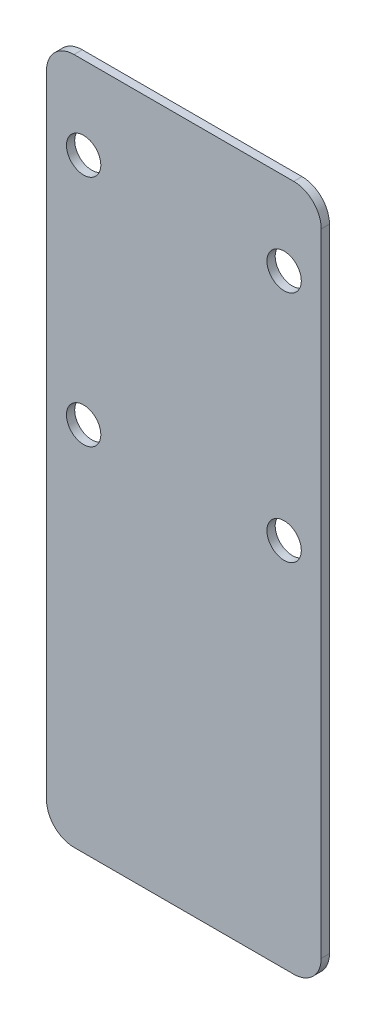
ISO-10303-21;
HEADER;
FILE_DESCRIPTION(('STEP AP214'),'2;1');
FILE_NAME('part.step','',(''),(''),'','','');
FILE_SCHEMA(('AUTOMOTIVE_DESIGN { 1 0 10303 214 1 1 1 1 }'));
ENDSEC;
DATA;
#1=APPLICATION_CONTEXT('core data for automotive mechanical design processes');
#2=APPLICATION_PROTOCOL_DEFINITION('international standard','automotive_design',2000,#1);
#3=PRODUCT_CONTEXT('',#1,'mechanical');
#4=PRODUCT('Part','Part','',(#3));
#5=PRODUCT_RELATED_PRODUCT_CATEGORY('part','',(#4));
#6=PRODUCT_DEFINITION_FORMATION('','',#4);
#7=PRODUCT_DEFINITION_CONTEXT('part definition',#1,'design');
#8=PRODUCT_DEFINITION('design','',#6,#7);
#9=PRODUCT_DEFINITION_SHAPE('','',#8);
#10=(LENGTH_UNIT() NAMED_UNIT(*) SI_UNIT(.MILLI.,.METRE.));
#11=(NAMED_UNIT(*) PLANE_ANGLE_UNIT() SI_UNIT($,.RADIAN.));
#12=(NAMED_UNIT(*) SI_UNIT($,.STERADIAN.) SOLID_ANGLE_UNIT());
#13=UNCERTAINTY_MEASURE_WITH_UNIT(LENGTH_MEASURE(1.E-05),#10,'distance_accuracy_value','');
#14=(GEOMETRIC_REPRESENTATION_CONTEXT(3) GLOBAL_UNCERTAINTY_ASSIGNED_CONTEXT((#13)) GLOBAL_UNIT_ASSIGNED_CONTEXT((#10,
#11,#12)) REPRESENTATION_CONTEXT('',''));
#15=CARTESIAN_POINT('',(0.,0.,0.));
#16=DIRECTION('',(0.,0.,1.));
#17=DIRECTION('',(1.,0.,0.));
#18=AXIS2_PLACEMENT_3D('',#15,#16,#17);
#19=CARTESIAN_POINT('',(1.16573417585641E-12,-7.7715611723761E-13,-222.));
#20=DIRECTION('',(0.,0.,-1.));
#21=DIRECTION('',(-1.,0.,0.));
#22=AXIS2_PLACEMENT_3D('',#19,#20,#21);
#23=PLANE('',#22);
#24=DIRECTION('',(-1.,0.,0.));
#25=VECTOR('',#24,1.);
#26=CARTESIAN_POINT('',(50.0000000000002,806.107463703936,-222.));
#27=LINE('',#26,#25);
#28=CARTESIAN_POINT('',(40.0000000000002,806.107463703936,-222.));
#29=VERTEX_POINT('',#28);
#30=CARTESIAN_POINT('',(-39.9999999999998,806.107463703936,-222.));
#31=VERTEX_POINT('',#30);
#32=EDGE_CURVE('E144',#29,#31,#27,.T.);
#33=ORIENTED_EDGE('',*,*,#32,.T.);
#34=CARTESIAN_POINT('',(-39.9999999999998,796.107463703936,-222.));
#35=DIRECTION('',(0.,0.,-1.));
#36=DIRECTION('',(-1.,0.,0.));
#37=AXIS2_PLACEMENT_3D('',#34,#35,#36);
#38=CIRCLE('',#37,10.);
#39=CARTESIAN_POINT('',(-49.9999999999998,796.107463703936,-222.));
#40=VERTEX_POINT('',#39);
#41=EDGE_CURVE('E162',#31,#40,#38,.F.);
#42=ORIENTED_EDGE('',*,*,#41,.T.);
#43=DIRECTION('',(0.,-1.,0.));
#44=VECTOR('',#43,1.);
#45=CARTESIAN_POINT('',(-49.9999999999998,806.107463703936,-222.));
#46=LINE('',#45,#44);
#47=CARTESIAN_POINT('',(-49.9999999999998,566.107463703936,-222.));
#48=VERTEX_POINT('',#47);
#49=EDGE_CURVE('E126',#40,#48,#46,.T.);
#50=ORIENTED_EDGE('',*,*,#49,.T.);
#51=CARTESIAN_POINT('',(-39.9999999999998,566.107463703936,-222.));
#52=DIRECTION('',(0.,0.,-1.));
#53=DIRECTION('',(-1.,0.,0.));
#54=AXIS2_PLACEMENT_3D('',#51,#52,#53);
#55=CIRCLE('',#54,10.);
#56=CARTESIAN_POINT('',(-39.9999999999998,556.107463703936,-222.));
#57=VERTEX_POINT('',#56);
#58=EDGE_CURVE('E159',#48,#57,#55,.F.);
#59=ORIENTED_EDGE('',*,*,#58,.T.);
#60=DIRECTION('',(1.,0.,0.));
#61=VECTOR('',#60,1.);
#62=CARTESIAN_POINT('',(50.0000000000002,556.107463703936,-222.));
#63=LINE('',#62,#61);
#64=CARTESIAN_POINT('',(40.0000000000002,556.107463703936,-222.));
#65=VERTEX_POINT('',#64);
#66=EDGE_CURVE('E173',#57,#65,#63,.T.);
#67=ORIENTED_EDGE('',*,*,#66,.T.);
#68=CARTESIAN_POINT('',(40.0000000000002,566.107463703936,-222.));
#69=DIRECTION('',(0.,0.,-1.));
#70=DIRECTION('',(-1.,0.,0.));
#71=AXIS2_PLACEMENT_3D('',#68,#69,#70);
#72=CIRCLE('',#71,10.);
#73=CARTESIAN_POINT('',(50.0000000000002,566.107463703936,-222.));
#74=VERTEX_POINT('',#73);
#75=EDGE_CURVE('E62',#65,#74,#72,.F.);
#76=ORIENTED_EDGE('',*,*,#75,.T.);
#77=DIRECTION('',(0.,1.,0.));
#78=VECTOR('',#77,1.);
#79=CARTESIAN_POINT('',(50.0000000000002,806.107463703936,-222.));
#80=LINE('',#79,#78);
#81=CARTESIAN_POINT('',(50.0000000000002,796.107463703936,-222.));
#82=VERTEX_POINT('',#81);
#83=EDGE_CURVE('E181',#74,#82,#80,.T.);
#84=ORIENTED_EDGE('',*,*,#83,.T.);
#85=CARTESIAN_POINT('',(40.0000000000002,796.107463703936,-222.));
#86=DIRECTION('',(0.,0.,-1.));
#87=DIRECTION('',(-1.,0.,0.));
#88=AXIS2_PLACEMENT_3D('',#85,#86,#87);
#89=CIRCLE('',#88,10.);
#90=EDGE_CURVE('E157',#82,#29,#89,.F.);
#91=ORIENTED_EDGE('',*,*,#90,.T.);
#92=EDGE_LOOP('',(#33,#42,#50,#59,#67,#76,#84,#91));
#93=FACE_BOUND('',#92,.T.);
#94=CARTESIAN_POINT('',(36.5000000000002,776.107463703936,-222.));
#95=DIRECTION('',(0.,0.,1.));
#96=DIRECTION('',(1.,0.,0.));
#97=AXIS2_PLACEMENT_3D('',#94,#95,#96);
#98=CIRCLE('',#97,6.24999999999994);
#99=CARTESIAN_POINT('',(42.7500000000001,776.107463703936,-222.));
#100=VERTEX_POINT('',#99);
#101=EDGE_CURVE('E135',#100,#100,#98,.T.);
#102=ORIENTED_EDGE('',*,*,#101,.F.);
#103=EDGE_LOOP('',(#102));
#104=FACE_BOUND('',#103,.T.);
#105=CARTESIAN_POINT('',(-36.4999999999998,776.107463703936,-222.));
#106=DIRECTION('',(0.,0.,1.));
#107=DIRECTION('',(-1.,0.,0.));
#108=AXIS2_PLACEMENT_3D('',#105,#106,#107);
#109=CIRCLE('',#108,6.24999999999994);
#110=CARTESIAN_POINT('',(-42.7499999999998,776.107463703936,-222.));
#111=VERTEX_POINT('',#110);
#112=EDGE_CURVE('E188',#111,#111,#109,.T.);
#113=ORIENTED_EDGE('',*,*,#112,.F.);
#114=EDGE_LOOP('',(#113));
#115=FACE_BOUND('',#114,.T.);
#116=CARTESIAN_POINT('',(36.5000000000002,691.107463703936,-222.));
#117=DIRECTION('',(0.,0.,1.));
#118=DIRECTION('',(1.,0.,0.));
#119=AXIS2_PLACEMENT_3D('',#116,#117,#118);
#120=CIRCLE('',#119,6.24999999999993);
#121=CARTESIAN_POINT('',(42.7500000000001,691.107463703936,-222.));
#122=VERTEX_POINT('',#121);
#123=EDGE_CURVE('E193',#122,#122,#120,.T.);
#124=ORIENTED_EDGE('',*,*,#123,.F.);
#125=EDGE_LOOP('',(#124));
#126=FACE_BOUND('',#125,.T.);
#127=CARTESIAN_POINT('',(-36.4999999999998,691.107463703936,-222.));
#128=DIRECTION('',(0.,0.,1.));
#129=DIRECTION('',(-1.,0.,0.));
#130=AXIS2_PLACEMENT_3D('',#127,#128,#129);
#131=CIRCLE('',#130,6.24999999999993);
#132=CARTESIAN_POINT('',(-42.7499999999998,691.107463703936,-222.));
#133=VERTEX_POINT('',#132);
#134=EDGE_CURVE('E199',#133,#133,#131,.T.);
#135=ORIENTED_EDGE('',*,*,#134,.F.);
#136=EDGE_LOOP('',(#135));
#137=FACE_BOUND('',#136,.T.);
#138=ADVANCED_FACE('F40',(#93,#104,#115,#126,#137),#23,.F.);
#139=CARTESIAN_POINT('',(1.16573417585641E-12,-7.7715611723761E-13,-225.));
#140=DIRECTION('',(0.,0.,-1.));
#141=DIRECTION('',(-1.,0.,0.));
#142=AXIS2_PLACEMENT_3D('',#139,#140,#141);
#143=PLANE('',#142);
#144=CARTESIAN_POINT('',(36.5000000000002,691.107463703936,-225.));
#145=DIRECTION('',(0.,0.,1.));
#146=DIRECTION('',(1.,0.,0.));
#147=AXIS2_PLACEMENT_3D('',#144,#145,#146);
#148=CIRCLE('',#147,6.24999999999993);
#149=CARTESIAN_POINT('',(42.7500000000001,691.107463703936,-225.));
#150=VERTEX_POINT('',#149);
#151=EDGE_CURVE('E196',#150,#150,#148,.T.);
#152=ORIENTED_EDGE('',*,*,#151,.T.);
#153=EDGE_LOOP('',(#152));
#154=FACE_BOUND('',#153,.T.);
#155=CARTESIAN_POINT('',(36.5000000000002,776.107463703936,-225.));
#156=DIRECTION('',(0.,0.,1.));
#157=DIRECTION('',(1.,0.,0.));
#158=AXIS2_PLACEMENT_3D('',#155,#156,#157);
#159=CIRCLE('',#158,6.24999999999994);
#160=CARTESIAN_POINT('',(42.7500000000001,776.107463703936,-225.));
#161=VERTEX_POINT('',#160);
#162=EDGE_CURVE('E141',#161,#161,#159,.T.);
#163=ORIENTED_EDGE('',*,*,#162,.T.);
#164=EDGE_LOOP('',(#163));
#165=FACE_BOUND('',#164,.T.);
#166=DIRECTION('',(0.,-1.,0.));
#167=VECTOR('',#166,1.);
#168=CARTESIAN_POINT('',(-49.9999999999998,806.107463703936,-225.));
#169=LINE('',#168,#167);
#170=CARTESIAN_POINT('',(-49.9999999999998,796.107463703936,-225.));
#171=VERTEX_POINT('',#170);
#172=CARTESIAN_POINT('',(-49.9999999999998,566.107463703936,-225.));
#173=VERTEX_POINT('',#172);
#174=EDGE_CURVE('E123',#171,#173,#169,.T.);
#175=ORIENTED_EDGE('',*,*,#174,.F.);
#176=CARTESIAN_POINT('',(-39.9999999999998,796.107463703936,-225.));
#177=DIRECTION('',(0.,0.,-1.));
#178=DIRECTION('',(-1.,0.,0.));
#179=AXIS2_PLACEMENT_3D('',#176,#177,#178);
#180=CIRCLE('',#179,10.);
#181=CARTESIAN_POINT('',(-39.9999999999998,806.107463703936,-225.));
#182=VERTEX_POINT('',#181);
#183=EDGE_CURVE('E106',#171,#182,#180,.T.);
#184=ORIENTED_EDGE('',*,*,#183,.T.);
#185=DIRECTION('',(-1.,0.,0.));
#186=VECTOR('',#185,1.);
#187=CARTESIAN_POINT('',(50.0000000000002,806.107463703936,-225.));
#188=LINE('',#187,#186);
#189=CARTESIAN_POINT('',(40.0000000000002,806.107463703936,-225.));
#190=VERTEX_POINT('',#189);
#191=EDGE_CURVE('E148',#190,#182,#188,.T.);
#192=ORIENTED_EDGE('',*,*,#191,.F.);
#193=CARTESIAN_POINT('',(40.0000000000002,796.107463703936,-225.));
#194=DIRECTION('',(0.,0.,-1.));
#195=DIRECTION('',(-1.,0.,0.));
#196=AXIS2_PLACEMENT_3D('',#193,#194,#195);
#197=CIRCLE('',#196,10.);
#198=CARTESIAN_POINT('',(50.0000000000002,796.107463703936,-225.));
#199=VERTEX_POINT('',#198);
#200=EDGE_CURVE('E127',#190,#199,#197,.T.);
#201=ORIENTED_EDGE('',*,*,#200,.T.);
#202=DIRECTION('',(0.,1.,0.));
#203=VECTOR('',#202,1.);
#204=CARTESIAN_POINT('',(50.0000000000002,806.107463703936,-225.));
#205=LINE('',#204,#203);
#206=CARTESIAN_POINT('',(50.0000000000002,566.107463703936,-225.));
#207=VERTEX_POINT('',#206);
#208=EDGE_CURVE('E138',#207,#199,#205,.T.);
#209=ORIENTED_EDGE('',*,*,#208,.F.);
#210=CARTESIAN_POINT('',(40.0000000000002,566.107463703936,-225.));
#211=DIRECTION('',(0.,0.,-1.));
#212=DIRECTION('',(-1.,0.,0.));
#213=AXIS2_PLACEMENT_3D('',#210,#211,#212);
#214=CIRCLE('',#213,10.);
#215=CARTESIAN_POINT('',(40.0000000000002,556.107463703936,-225.));
#216=VERTEX_POINT('',#215);
#217=EDGE_CURVE('E117',#207,#216,#214,.T.);
#218=ORIENTED_EDGE('',*,*,#217,.T.);
#219=DIRECTION('',(1.,0.,0.));
#220=VECTOR('',#219,1.);
#221=CARTESIAN_POINT('',(50.0000000000002,556.107463703936,-225.));
#222=LINE('',#221,#220);
#223=CARTESIAN_POINT('',(-39.9999999999998,556.107463703936,-225.));
#224=VERTEX_POINT('',#223);
#225=EDGE_CURVE('E134',#224,#216,#222,.T.);
#226=ORIENTED_EDGE('',*,*,#225,.F.);
#227=CARTESIAN_POINT('',(-39.9999999999998,566.107463703936,-225.));
#228=DIRECTION('',(0.,0.,-1.));
#229=DIRECTION('',(-1.,0.,0.));
#230=AXIS2_PLACEMENT_3D('',#227,#228,#229);
#231=CIRCLE('',#230,10.);
#232=EDGE_CURVE('E133',#224,#173,#231,.T.);
#233=ORIENTED_EDGE('',*,*,#232,.T.);
#234=EDGE_LOOP('',(#175,#184,#192,#201,#209,#218,#226,#233));
#235=FACE_BOUND('',#234,.T.);
#236=CARTESIAN_POINT('',(-36.4999999999998,776.107463703936,-225.));
#237=DIRECTION('',(0.,0.,1.));
#238=DIRECTION('',(-1.,0.,0.));
#239=AXIS2_PLACEMENT_3D('',#236,#237,#238);
#240=CIRCLE('',#239,6.24999999999994);
#241=CARTESIAN_POINT('',(-42.7499999999998,776.107463703936,-225.));
#242=VERTEX_POINT('',#241);
#243=EDGE_CURVE('E190',#242,#242,#240,.T.);
#244=ORIENTED_EDGE('',*,*,#243,.T.);
#245=EDGE_LOOP('',(#244));
#246=FACE_BOUND('',#245,.T.);
#247=CARTESIAN_POINT('',(-36.4999999999998,691.107463703936,-225.));
#248=DIRECTION('',(0.,0.,1.));
#249=DIRECTION('',(-1.,0.,0.));
#250=AXIS2_PLACEMENT_3D('',#247,#248,#249);
#251=CIRCLE('',#250,6.24999999999993);
#252=CARTESIAN_POINT('',(-42.7499999999998,691.107463703936,-225.));
#253=VERTEX_POINT('',#252);
#254=EDGE_CURVE('E202',#253,#253,#251,.T.);
#255=ORIENTED_EDGE('',*,*,#254,.T.);
#256=EDGE_LOOP('',(#255));
#257=FACE_BOUND('',#256,.T.);
#258=ADVANCED_FACE('F130',(#154,#165,#235,#246,#257),#143,.T.);
#259=CARTESIAN_POINT('',(-49.9999999999998,806.107463703936,-222.));
#260=DIRECTION('',(1.,0.,0.));
#261=DIRECTION('',(0.,1.,0.));
#262=AXIS2_PLACEMENT_3D('',#259,#260,#261);
#263=PLANE('',#262);
#264=ORIENTED_EDGE('',*,*,#49,.F.);
#265=DIRECTION('',(0.,0.,-1.));
#266=VECTOR('',#265,1.);
#267=CARTESIAN_POINT('',(-49.9999999999998,796.107463703936,-222.));
#268=LINE('',#267,#266);
#269=EDGE_CURVE('E110',#40,#171,#268,.T.);
#270=ORIENTED_EDGE('',*,*,#269,.T.);
#271=ORIENTED_EDGE('',*,*,#174,.T.);
#272=DIRECTION('',(0.,0.,-1.));
#273=VECTOR('',#272,1.);
#274=CARTESIAN_POINT('',(-49.9999999999998,566.107463703936,-222.));
#275=LINE('',#274,#273);
#276=EDGE_CURVE('E128',#173,#48,#275,.F.);
#277=ORIENTED_EDGE('',*,*,#276,.T.);
#278=EDGE_LOOP('',(#264,#270,#271,#277));
#279=FACE_BOUND('',#278,.T.);
#280=ADVANCED_FACE('F122',(#279),#263,.F.);
#281=CARTESIAN_POINT('',(50.0000000000002,556.107463703936,-222.));
#282=DIRECTION('',(0.,1.,0.));
#283=DIRECTION('',(0.,0.,1.));
#284=AXIS2_PLACEMENT_3D('',#281,#282,#283);
#285=PLANE('',#284);
#286=ORIENTED_EDGE('',*,*,#225,.T.);
#287=DIRECTION('',(0.,0.,-1.));
#288=VECTOR('',#287,1.);
#289=CARTESIAN_POINT('',(40.0000000000002,556.107463703936,-222.));
#290=LINE('',#289,#288);
#291=EDGE_CURVE('E11',#216,#65,#290,.F.);
#292=ORIENTED_EDGE('',*,*,#291,.T.);
#293=ORIENTED_EDGE('',*,*,#66,.F.);
#294=DIRECTION('',(0.,0.,-1.));
#295=VECTOR('',#294,1.);
#296=CARTESIAN_POINT('',(-39.9999999999998,556.107463703936,-222.));
#297=LINE('',#296,#295);
#298=EDGE_CURVE('E48',#57,#224,#297,.T.);
#299=ORIENTED_EDGE('',*,*,#298,.T.);
#300=EDGE_LOOP('',(#286,#292,#293,#299));
#301=FACE_BOUND('',#300,.T.);
#302=ADVANCED_FACE('F171',(#301),#285,.F.);
#303=CARTESIAN_POINT('',(50.0000000000002,806.107463703936,-222.));
#304=DIRECTION('',(-1.,0.,0.));
#305=DIRECTION('',(0.,-1.,0.));
#306=AXIS2_PLACEMENT_3D('',#303,#304,#305);
#307=PLANE('',#306);
#308=ORIENTED_EDGE('',*,*,#83,.F.);
#309=DIRECTION('',(0.,0.,-1.));
#310=VECTOR('',#309,1.);
#311=CARTESIAN_POINT('',(50.0000000000002,566.107463703936,-222.));
#312=LINE('',#311,#310);
#313=EDGE_CURVE('E165',#74,#207,#312,.T.);
#314=ORIENTED_EDGE('',*,*,#313,.T.);
#315=ORIENTED_EDGE('',*,*,#208,.T.);
#316=DIRECTION('',(0.,0.,-1.));
#317=VECTOR('',#316,1.);
#318=CARTESIAN_POINT('',(50.0000000000002,796.107463703936,-222.));
#319=LINE('',#318,#317);
#320=EDGE_CURVE('E55',#199,#82,#319,.F.);
#321=ORIENTED_EDGE('',*,*,#320,.T.);
#322=EDGE_LOOP('',(#308,#314,#315,#321));
#323=FACE_BOUND('',#322,.T.);
#324=ADVANCED_FACE('F180',(#323),#307,.F.);
#325=CARTESIAN_POINT('',(50.0000000000002,806.107463703936,-222.));
#326=DIRECTION('',(0.,-1.,0.));
#327=DIRECTION('',(0.,0.,-1.));
#328=AXIS2_PLACEMENT_3D('',#325,#326,#327);
#329=PLANE('',#328);
#330=ORIENTED_EDGE('',*,*,#191,.T.);
#331=DIRECTION('',(0.,0.,-1.));
#332=VECTOR('',#331,1.);
#333=CARTESIAN_POINT('',(-39.9999999999998,806.107463703936,-222.));
#334=LINE('',#333,#332);
#335=EDGE_CURVE('E111',#182,#31,#334,.F.);
#336=ORIENTED_EDGE('',*,*,#335,.T.);
#337=ORIENTED_EDGE('',*,*,#32,.F.);
#338=DIRECTION('',(0.,0.,-1.));
#339=VECTOR('',#338,1.);
#340=CARTESIAN_POINT('',(40.0000000000002,806.107463703936,-222.));
#341=LINE('',#340,#339);
#342=EDGE_CURVE('E116',#29,#190,#341,.T.);
#343=ORIENTED_EDGE('',*,*,#342,.T.);
#344=EDGE_LOOP('',(#330,#336,#337,#343));
#345=FACE_BOUND('',#344,.T.);
#346=ADVANCED_FACE('F223',(#345),#329,.F.);
#347=CARTESIAN_POINT('',(36.5000000000002,776.107463703936,-222.));
#348=DIRECTION('',(0.,0.,-1.));
#349=DIRECTION('',(-1.,0.,0.));
#350=AXIS2_PLACEMENT_3D('',#347,#348,#349);
#351=CYLINDRICAL_SURFACE('',#350,6.24999999999994);
#352=ORIENTED_EDGE('',*,*,#101,.T.);
#353=EDGE_LOOP('',(#352));
#354=FACE_BOUND('',#353,.T.);
#355=ORIENTED_EDGE('',*,*,#162,.F.);
#356=EDGE_LOOP('',(#355));
#357=FACE_BOUND('',#356,.T.);
#358=ADVANCED_FACE('F220',(#354,#357),#351,.F.);
#359=CARTESIAN_POINT('',(-36.4999999999998,776.107463703936,-222.));
#360=DIRECTION('',(0.,0.,-1.));
#361=DIRECTION('',(-1.,0.,0.));
#362=AXIS2_PLACEMENT_3D('',#359,#360,#361);
#363=CYLINDRICAL_SURFACE('',#362,6.24999999999994);
#364=ORIENTED_EDGE('',*,*,#112,.T.);
#365=EDGE_LOOP('',(#364));
#366=FACE_BOUND('',#365,.T.);
#367=ORIENTED_EDGE('',*,*,#243,.F.);
#368=EDGE_LOOP('',(#367));
#369=FACE_BOUND('',#368,.T.);
#370=ADVANCED_FACE('F281',(#366,#369),#363,.F.);
#371=CARTESIAN_POINT('',(36.5000000000002,691.107463703936,-222.));
#372=DIRECTION('',(0.,0.,-1.));
#373=DIRECTION('',(-1.,0.,0.));
#374=AXIS2_PLACEMENT_3D('',#371,#372,#373);
#375=CYLINDRICAL_SURFACE('',#374,6.24999999999993);
#376=ORIENTED_EDGE('',*,*,#123,.T.);
#377=EDGE_LOOP('',(#376));
#378=FACE_BOUND('',#377,.T.);
#379=ORIENTED_EDGE('',*,*,#151,.F.);
#380=EDGE_LOOP('',(#379));
#381=FACE_BOUND('',#380,.T.);
#382=ADVANCED_FACE('F271',(#378,#381),#375,.F.);
#383=CARTESIAN_POINT('',(-36.4999999999998,691.107463703936,-222.));
#384=DIRECTION('',(0.,0.,-1.));
#385=DIRECTION('',(-1.,0.,0.));
#386=AXIS2_PLACEMENT_3D('',#383,#384,#385);
#387=CYLINDRICAL_SURFACE('',#386,6.24999999999993);
#388=ORIENTED_EDGE('',*,*,#134,.T.);
#389=EDGE_LOOP('',(#388));
#390=FACE_BOUND('',#389,.T.);
#391=ORIENTED_EDGE('',*,*,#254,.F.);
#392=EDGE_LOOP('',(#391));
#393=FACE_BOUND('',#392,.T.);
#394=ADVANCED_FACE('F208',(#390,#393),#387,.F.);
#395=CARTESIAN_POINT('',(-39.9999999999998,796.107463703936,-222.));
#396=DIRECTION('',(0.,0.,-1.));
#397=DIRECTION('',(-1.,0.,0.));
#398=AXIS2_PLACEMENT_3D('',#395,#396,#397);
#399=CYLINDRICAL_SURFACE('',#398,10.);
#400=ORIENTED_EDGE('',*,*,#41,.F.);
#401=ORIENTED_EDGE('',*,*,#335,.F.);
#402=ORIENTED_EDGE('',*,*,#183,.F.);
#403=ORIENTED_EDGE('',*,*,#269,.F.);
#404=EDGE_LOOP('',(#400,#401,#402,#403));
#405=FACE_BOUND('',#404,.T.);
#406=ADVANCED_FACE('F109',(#405),#399,.T.);
#407=CARTESIAN_POINT('',(40.0000000000002,566.107463703936,-222.));
#408=DIRECTION('',(0.,0.,-1.));
#409=DIRECTION('',(-1.,0.,0.));
#410=AXIS2_PLACEMENT_3D('',#407,#408,#409);
#411=CYLINDRICAL_SURFACE('',#410,10.);
#412=ORIENTED_EDGE('',*,*,#75,.F.);
#413=ORIENTED_EDGE('',*,*,#291,.F.);
#414=ORIENTED_EDGE('',*,*,#217,.F.);
#415=ORIENTED_EDGE('',*,*,#313,.F.);
#416=EDGE_LOOP('',(#412,#413,#414,#415));
#417=FACE_BOUND('',#416,.T.);
#418=ADVANCED_FACE('F179',(#417),#411,.T.);
#419=CARTESIAN_POINT('',(-39.9999999999998,566.107463703936,-222.));
#420=DIRECTION('',(0.,0.,-1.));
#421=DIRECTION('',(-1.,0.,0.));
#422=AXIS2_PLACEMENT_3D('',#419,#420,#421);
#423=CYLINDRICAL_SURFACE('',#422,10.);
#424=ORIENTED_EDGE('',*,*,#58,.F.);
#425=ORIENTED_EDGE('',*,*,#276,.F.);
#426=ORIENTED_EDGE('',*,*,#232,.F.);
#427=ORIENTED_EDGE('',*,*,#298,.F.);
#428=EDGE_LOOP('',(#424,#425,#426,#427));
#429=FACE_BOUND('',#428,.T.);
#430=ADVANCED_FACE('F236',(#429),#423,.T.);
#431=CARTESIAN_POINT('',(40.0000000000002,796.107463703936,-222.));
#432=DIRECTION('',(0.,0.,-1.));
#433=DIRECTION('',(-1.,0.,0.));
#434=AXIS2_PLACEMENT_3D('',#431,#432,#433);
#435=CYLINDRICAL_SURFACE('',#434,10.);
#436=ORIENTED_EDGE('',*,*,#90,.F.);
#437=ORIENTED_EDGE('',*,*,#320,.F.);
#438=ORIENTED_EDGE('',*,*,#200,.F.);
#439=ORIENTED_EDGE('',*,*,#342,.F.);
#440=EDGE_LOOP('',(#436,#437,#438,#439));
#441=FACE_BOUND('',#440,.T.);
#442=ADVANCED_FACE('F42',(#441),#435,.T.);
#443=CLOSED_SHELL('',(#138,#258,#280,#302,#324,#346,#358,#370,#382,#394,#406,#418,#430,#442));
#444=MANIFOLD_SOLID_BREP('B2',#443);
#445=ADVANCED_BREP_SHAPE_REPRESENTATION('',(#18,#444),#14);
#446=SHAPE_DEFINITION_REPRESENTATION(#9,#445);
ENDSEC;
END-ISO-10303-21;
